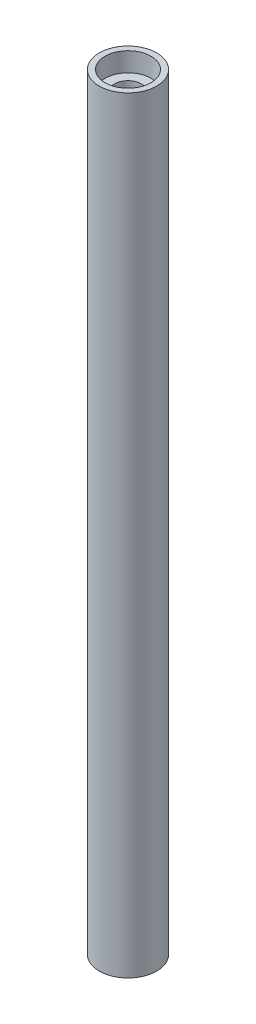
ISO-10303-21;
HEADER;
FILE_DESCRIPTION(('STEP AP214'),'2;1');
FILE_NAME('part.step','',(''),(''),'','','');
FILE_SCHEMA(('AUTOMOTIVE_DESIGN { 1 0 10303 214 1 1 1 1 }'));
ENDSEC;
DATA;
#1=APPLICATION_CONTEXT('core data for automotive mechanical design processes');
#2=APPLICATION_PROTOCOL_DEFINITION('international standard','automotive_design',2000,#1);
#3=PRODUCT_CONTEXT('',#1,'mechanical');
#4=PRODUCT('Part','Part','',(#3));
#5=PRODUCT_RELATED_PRODUCT_CATEGORY('part','',(#4));
#6=PRODUCT_DEFINITION_FORMATION('','',#4);
#7=PRODUCT_DEFINITION_CONTEXT('part definition',#1,'design');
#8=PRODUCT_DEFINITION('design','',#6,#7);
#9=PRODUCT_DEFINITION_SHAPE('','',#8);
#10=(LENGTH_UNIT() NAMED_UNIT(*) SI_UNIT(.MILLI.,.METRE.));
#11=(NAMED_UNIT(*) PLANE_ANGLE_UNIT() SI_UNIT($,.RADIAN.));
#12=(NAMED_UNIT(*) SI_UNIT($,.STERADIAN.) SOLID_ANGLE_UNIT());
#13=UNCERTAINTY_MEASURE_WITH_UNIT(LENGTH_MEASURE(1.E-05),#10,'distance_accuracy_value','');
#14=(GEOMETRIC_REPRESENTATION_CONTEXT(3) GLOBAL_UNCERTAINTY_ASSIGNED_CONTEXT((#13)) GLOBAL_UNIT_ASSIGNED_CONTEXT((#10,
#11,#12)) REPRESENTATION_CONTEXT('',''));
#15=CARTESIAN_POINT('',(0.,0.,0.));
#16=DIRECTION('',(0.,0.,1.));
#17=DIRECTION('',(1.,0.,0.));
#18=AXIS2_PLACEMENT_3D('',#15,#16,#17);
#19=CARTESIAN_POINT('',(0.,0.,0.));
#20=DIRECTION('',(0.,1.,0.));
#21=DIRECTION('',(0.,0.,1.));
#22=AXIS2_PLACEMENT_3D('',#19,#20,#21);
#23=CYLINDRICAL_SURFACE('',#22,3.5);
#24=CARTESIAN_POINT('',(0.,195.,0.));
#25=DIRECTION('',(0.,1.,0.));
#26=DIRECTION('',(0.,0.,1.));
#27=AXIS2_PLACEMENT_3D('',#24,#25,#26);
#28=CIRCLE('',#27,3.5);
#29=CARTESIAN_POINT('',(0.,195.,3.5));
#30=VERTEX_POINT('',#29);
#31=EDGE_CURVE('E46',#30,#30,#28,.F.);
#32=ORIENTED_EDGE('',*,*,#31,.F.);
#33=EDGE_LOOP('',(#32));
#34=FACE_BOUND('',#33,.T.);
#35=CARTESIAN_POINT('',(0.,5.,0.));
#36=DIRECTION('',(0.,-1.,0.));
#37=DIRECTION('',(0.,0.,-1.));
#38=AXIS2_PLACEMENT_3D('',#35,#36,#37);
#39=CIRCLE('',#38,3.5);
#40=CARTESIAN_POINT('',(0.,5.,-3.5));
#41=VERTEX_POINT('',#40);
#42=EDGE_CURVE('E37',#41,#41,#39,.F.);
#43=ORIENTED_EDGE('',*,*,#42,.F.);
#44=EDGE_LOOP('',(#43));
#45=FACE_BOUND('',#44,.T.);
#46=ADVANCED_FACE('F33',(#34,#45),#23,.F.);
#47=CARTESIAN_POINT('',(0.,200.,0.));
#48=DIRECTION('',(0.,-1.,0.));
#49=DIRECTION('',(0.,0.,-1.));
#50=AXIS2_PLACEMENT_3D('',#47,#48,#49);
#51=CYLINDRICAL_SURFACE('',#50,7.5);
#52=CARTESIAN_POINT('',(0.,200.,0.));
#53=DIRECTION('',(0.,1.,0.));
#54=DIRECTION('',(0.,0.,1.));
#55=AXIS2_PLACEMENT_3D('',#52,#53,#54);
#56=CIRCLE('',#55,7.5);
#57=CARTESIAN_POINT('',(0.,200.,7.5));
#58=VERTEX_POINT('',#57);
#59=EDGE_CURVE('E10',#58,#58,#56,.T.);
#60=ORIENTED_EDGE('',*,*,#59,.F.);
#61=EDGE_LOOP('',(#60));
#62=FACE_BOUND('',#61,.T.);
#63=CARTESIAN_POINT('',(0.,0.,0.));
#64=DIRECTION('',(0.,1.,0.));
#65=DIRECTION('',(0.,0.,1.));
#66=AXIS2_PLACEMENT_3D('',#63,#64,#65);
#67=CIRCLE('',#66,7.5);
#68=CARTESIAN_POINT('',(0.,0.,7.5));
#69=VERTEX_POINT('',#68);
#70=EDGE_CURVE('E41',#69,#69,#67,.T.);
#71=ORIENTED_EDGE('',*,*,#70,.T.);
#72=EDGE_LOOP('',(#71));
#73=FACE_BOUND('',#72,.T.);
#74=ADVANCED_FACE('F35',(#62,#73),#51,.T.);
#75=CARTESIAN_POINT('',(0.,200.,0.));
#76=DIRECTION('',(0.,1.,0.));
#77=DIRECTION('',(0.,0.,1.));
#78=AXIS2_PLACEMENT_3D('',#75,#76,#77);
#79=PLANE('',#78);
#80=CARTESIAN_POINT('',(0.,200.,0.));
#81=DIRECTION('',(0.,1.,0.));
#82=DIRECTION('',(0.,0.,1.));
#83=AXIS2_PLACEMENT_3D('',#80,#81,#82);
#84=CIRCLE('',#83,6.);
#85=CARTESIAN_POINT('',(0.,200.,6.));
#86=VERTEX_POINT('',#85);
#87=EDGE_CURVE('E49',#86,#86,#84,.T.);
#88=ORIENTED_EDGE('',*,*,#87,.F.);
#89=EDGE_LOOP('',(#88));
#90=FACE_BOUND('',#89,.T.);
#91=ORIENTED_EDGE('',*,*,#59,.T.);
#92=EDGE_LOOP('',(#91));
#93=FACE_BOUND('',#92,.T.);
#94=ADVANCED_FACE('F78',(#90,#93),#79,.T.);
#95=CARTESIAN_POINT('',(0.,0.,0.));
#96=DIRECTION('',(0.,1.,0.));
#97=DIRECTION('',(0.,0.,1.));
#98=AXIS2_PLACEMENT_3D('',#95,#96,#97);
#99=PLANE('',#98);
#100=CARTESIAN_POINT('',(0.,0.,0.));
#101=DIRECTION('',(0.,-1.,0.));
#102=DIRECTION('',(0.,0.,-1.));
#103=AXIS2_PLACEMENT_3D('',#100,#101,#102);
#104=CIRCLE('',#103,6.);
#105=CARTESIAN_POINT('',(0.,0.,-6.));
#106=VERTEX_POINT('',#105);
#107=EDGE_CURVE('E60',#106,#106,#104,.T.);
#108=ORIENTED_EDGE('',*,*,#107,.F.);
#109=EDGE_LOOP('',(#108));
#110=FACE_BOUND('',#109,.T.);
#111=ORIENTED_EDGE('',*,*,#70,.F.);
#112=EDGE_LOOP('',(#111));
#113=FACE_BOUND('',#112,.T.);
#114=ADVANCED_FACE('F85',(#110,#113),#99,.F.);
#115=CARTESIAN_POINT('',(0.,195.,0.));
#116=DIRECTION('',(0.,1.,0.));
#117=DIRECTION('',(0.,0.,1.));
#118=AXIS2_PLACEMENT_3D('',#115,#116,#117);
#119=PLANE('',#118);
#120=CARTESIAN_POINT('',(0.,195.,0.));
#121=DIRECTION('',(0.,1.,0.));
#122=DIRECTION('',(0.,0.,1.));
#123=AXIS2_PLACEMENT_3D('',#120,#121,#122);
#124=CIRCLE('',#123,6.);
#125=CARTESIAN_POINT('',(0.,195.,6.));
#126=VERTEX_POINT('',#125);
#127=EDGE_CURVE('E52',#126,#126,#124,.T.);
#128=ORIENTED_EDGE('',*,*,#127,.T.);
#129=EDGE_LOOP('',(#128));
#130=FACE_BOUND('',#129,.T.);
#131=ORIENTED_EDGE('',*,*,#31,.T.);
#132=EDGE_LOOP('',(#131));
#133=FACE_BOUND('',#132,.T.);
#134=ADVANCED_FACE('F88',(#130,#133),#119,.T.);
#135=CARTESIAN_POINT('',(0.,195.,0.));
#136=DIRECTION('',(0.,1.,0.));
#137=DIRECTION('',(0.,0.,1.));
#138=AXIS2_PLACEMENT_3D('',#135,#136,#137);
#139=CYLINDRICAL_SURFACE('',#138,6.);
#140=ORIENTED_EDGE('',*,*,#127,.F.);
#141=EDGE_LOOP('',(#140));
#142=FACE_BOUND('',#141,.T.);
#143=ORIENTED_EDGE('',*,*,#87,.T.);
#144=EDGE_LOOP('',(#143));
#145=FACE_BOUND('',#144,.T.);
#146=ADVANCED_FACE('F82',(#142,#145),#139,.F.);
#147=CARTESIAN_POINT('',(0.,5.,0.));
#148=DIRECTION('',(0.,-1.,0.));
#149=DIRECTION('',(0.,0.,-1.));
#150=AXIS2_PLACEMENT_3D('',#147,#148,#149);
#151=PLANE('',#150);
#152=CARTESIAN_POINT('',(0.,5.,0.));
#153=DIRECTION('',(0.,-1.,0.));
#154=DIRECTION('',(0.,0.,-1.));
#155=AXIS2_PLACEMENT_3D('',#152,#153,#154);
#156=CIRCLE('',#155,6.);
#157=CARTESIAN_POINT('',(0.,5.,-6.));
#158=VERTEX_POINT('',#157);
#159=EDGE_CURVE('E63',#158,#158,#156,.T.);
#160=ORIENTED_EDGE('',*,*,#159,.T.);
#161=EDGE_LOOP('',(#160));
#162=FACE_BOUND('',#161,.T.);
#163=ORIENTED_EDGE('',*,*,#42,.T.);
#164=EDGE_LOOP('',(#163));
#165=FACE_BOUND('',#164,.T.);
#166=ADVANCED_FACE('F70',(#162,#165),#151,.T.);
#167=CARTESIAN_POINT('',(0.,5.,0.));
#168=DIRECTION('',(0.,-1.,0.));
#169=DIRECTION('',(0.,0.,-1.));
#170=AXIS2_PLACEMENT_3D('',#167,#168,#169);
#171=CYLINDRICAL_SURFACE('',#170,6.);
#172=ORIENTED_EDGE('',*,*,#159,.F.);
#173=EDGE_LOOP('',(#172));
#174=FACE_BOUND('',#173,.T.);
#175=ORIENTED_EDGE('',*,*,#107,.T.);
#176=EDGE_LOOP('',(#175));
#177=FACE_BOUND('',#176,.T.);
#178=ADVANCED_FACE('F98',(#174,#177),#171,.F.);
#179=CLOSED_SHELL('',(#46,#74,#94,#114,#134,#146,#166,#178));
#180=MANIFOLD_SOLID_BREP('B2',#179);
#181=ADVANCED_BREP_SHAPE_REPRESENTATION('',(#18,#180),#14);
#182=SHAPE_DEFINITION_REPRESENTATION(#9,#181);
ENDSEC;
END-ISO-10303-21;
